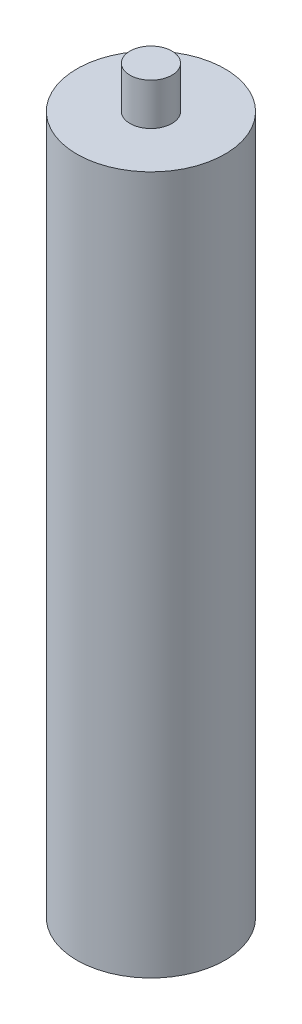
ISO-10303-21;
HEADER;
FILE_DESCRIPTION(('STEP AP214'),'2;1');
FILE_NAME('part.step','',(''),(''),'','','');
FILE_SCHEMA(('AUTOMOTIVE_DESIGN { 1 0 10303 214 1 1 1 1 }'));
ENDSEC;
DATA;
#1=APPLICATION_CONTEXT('core data for automotive mechanical design processes');
#2=APPLICATION_PROTOCOL_DEFINITION('international standard','automotive_design',2000,#1);
#3=PRODUCT_CONTEXT('',#1,'mechanical');
#4=PRODUCT('Part','Part','',(#3));
#5=PRODUCT_RELATED_PRODUCT_CATEGORY('part','',(#4));
#6=PRODUCT_DEFINITION_FORMATION('','',#4);
#7=PRODUCT_DEFINITION_CONTEXT('part definition',#1,'design');
#8=PRODUCT_DEFINITION('design','',#6,#7);
#9=PRODUCT_DEFINITION_SHAPE('','',#8);
#10=(LENGTH_UNIT() NAMED_UNIT(*) SI_UNIT(.MILLI.,.METRE.));
#11=(NAMED_UNIT(*) PLANE_ANGLE_UNIT() SI_UNIT($,.RADIAN.));
#12=(NAMED_UNIT(*) SI_UNIT($,.STERADIAN.) SOLID_ANGLE_UNIT());
#13=UNCERTAINTY_MEASURE_WITH_UNIT(LENGTH_MEASURE(1.E-05),#10,'distance_accuracy_value','');
#14=(GEOMETRIC_REPRESENTATION_CONTEXT(3) GLOBAL_UNCERTAINTY_ASSIGNED_CONTEXT((#13)) GLOBAL_UNIT_ASSIGNED_CONTEXT((#10,
#11,#12)) REPRESENTATION_CONTEXT('',''));
#15=CARTESIAN_POINT('',(0.,0.,0.));
#16=DIRECTION('',(0.,0.,1.));
#17=DIRECTION('',(1.,0.,0.));
#18=AXIS2_PLACEMENT_3D('',#15,#16,#17);
#19=CARTESIAN_POINT('',(0.,250.,0.));
#20=DIRECTION('',(0.,-1.,0.));
#21=DIRECTION('',(0.,0.,-1.));
#22=AXIS2_PLACEMENT_3D('',#19,#20,#21);
#23=CYLINDRICAL_SURFACE('',#22,26.5);
#24=CARTESIAN_POINT('',(0.,250.,0.));
#25=DIRECTION('',(0.,1.,0.));
#26=DIRECTION('',(0.,0.,1.));
#27=AXIS2_PLACEMENT_3D('',#24,#25,#26);
#28=CIRCLE('',#27,26.5);
#29=CARTESIAN_POINT('',(0.,250.,26.5));
#30=VERTEX_POINT('',#29);
#31=EDGE_CURVE('E10',#30,#30,#28,.T.);
#32=ORIENTED_EDGE('',*,*,#31,.F.);
#33=EDGE_LOOP('',(#32));
#34=FACE_BOUND('',#33,.T.);
#35=CARTESIAN_POINT('',(0.,0.,0.));
#36=DIRECTION('',(0.,1.,0.));
#37=DIRECTION('',(0.,0.,1.));
#38=AXIS2_PLACEMENT_3D('',#35,#36,#37);
#39=CIRCLE('',#38,26.5);
#40=CARTESIAN_POINT('',(0.,0.,26.5));
#41=VERTEX_POINT('',#40);
#42=EDGE_CURVE('E33',#41,#41,#39,.T.);
#43=ORIENTED_EDGE('',*,*,#42,.T.);
#44=EDGE_LOOP('',(#43));
#45=FACE_BOUND('',#44,.T.);
#46=ADVANCED_FACE('F30',(#34,#45),#23,.T.);
#47=CARTESIAN_POINT('',(0.,250.,0.));
#48=DIRECTION('',(0.,1.,0.));
#49=DIRECTION('',(0.,0.,1.));
#50=AXIS2_PLACEMENT_3D('',#47,#48,#49);
#51=PLANE('',#50);
#52=CARTESIAN_POINT('',(0.,250.,0.));
#53=DIRECTION('',(0.,1.,0.));
#54=DIRECTION('',(0.,0.,1.));
#55=AXIS2_PLACEMENT_3D('',#52,#53,#54);
#56=CIRCLE('',#55,7.5);
#57=CARTESIAN_POINT('',(0.,250.,7.5));
#58=VERTEX_POINT('',#57);
#59=EDGE_CURVE('E42',#58,#58,#56,.T.);
#60=ORIENTED_EDGE('',*,*,#59,.F.);
#61=EDGE_LOOP('',(#60));
#62=FACE_BOUND('',#61,.T.);
#63=ORIENTED_EDGE('',*,*,#31,.T.);
#64=EDGE_LOOP('',(#63));
#65=FACE_BOUND('',#64,.T.);
#66=ADVANCED_FACE('F57',(#62,#65),#51,.T.);
#67=CARTESIAN_POINT('',(0.,0.,0.));
#68=DIRECTION('',(0.,1.,0.));
#69=DIRECTION('',(0.,0.,1.));
#70=AXIS2_PLACEMENT_3D('',#67,#68,#69);
#71=PLANE('',#70);
#72=ORIENTED_EDGE('',*,*,#42,.F.);
#73=EDGE_LOOP('',(#72));
#74=FACE_BOUND('',#73,.T.);
#75=ADVANCED_FACE('F53',(#74),#71,.F.);
#76=CARTESIAN_POINT('',(0.,265.,0.));
#77=DIRECTION('',(0.,-1.,0.));
#78=DIRECTION('',(0.,0.,-1.));
#79=AXIS2_PLACEMENT_3D('',#76,#77,#78);
#80=CYLINDRICAL_SURFACE('',#79,7.5);
#81=CARTESIAN_POINT('',(0.,265.,0.));
#82=DIRECTION('',(0.,1.,0.));
#83=DIRECTION('',(0.,0.,1.));
#84=AXIS2_PLACEMENT_3D('',#81,#82,#83);
#85=CIRCLE('',#84,7.5);
#86=CARTESIAN_POINT('',(0.,265.,7.5));
#87=VERTEX_POINT('',#86);
#88=EDGE_CURVE('E40',#87,#87,#85,.T.);
#89=ORIENTED_EDGE('',*,*,#88,.F.);
#90=EDGE_LOOP('',(#89));
#91=FACE_BOUND('',#90,.T.);
#92=ORIENTED_EDGE('',*,*,#59,.T.);
#93=EDGE_LOOP('',(#92));
#94=FACE_BOUND('',#93,.T.);
#95=ADVANCED_FACE('F50',(#91,#94),#80,.T.);
#96=CARTESIAN_POINT('',(0.,265.,0.));
#97=DIRECTION('',(0.,1.,0.));
#98=DIRECTION('',(0.,0.,1.));
#99=AXIS2_PLACEMENT_3D('',#96,#97,#98);
#100=PLANE('',#99);
#101=ORIENTED_EDGE('',*,*,#88,.T.);
#102=EDGE_LOOP('',(#101));
#103=FACE_BOUND('',#102,.T.);
#104=ADVANCED_FACE('F48',(#103),#100,.T.);
#105=CLOSED_SHELL('',(#46,#66,#75,#95,#104));
#106=MANIFOLD_SOLID_BREP('B2',#105);
#107=ADVANCED_BREP_SHAPE_REPRESENTATION('',(#18,#106),#14);
#108=SHAPE_DEFINITION_REPRESENTATION(#9,#107);
ENDSEC;
END-ISO-10303-21;
